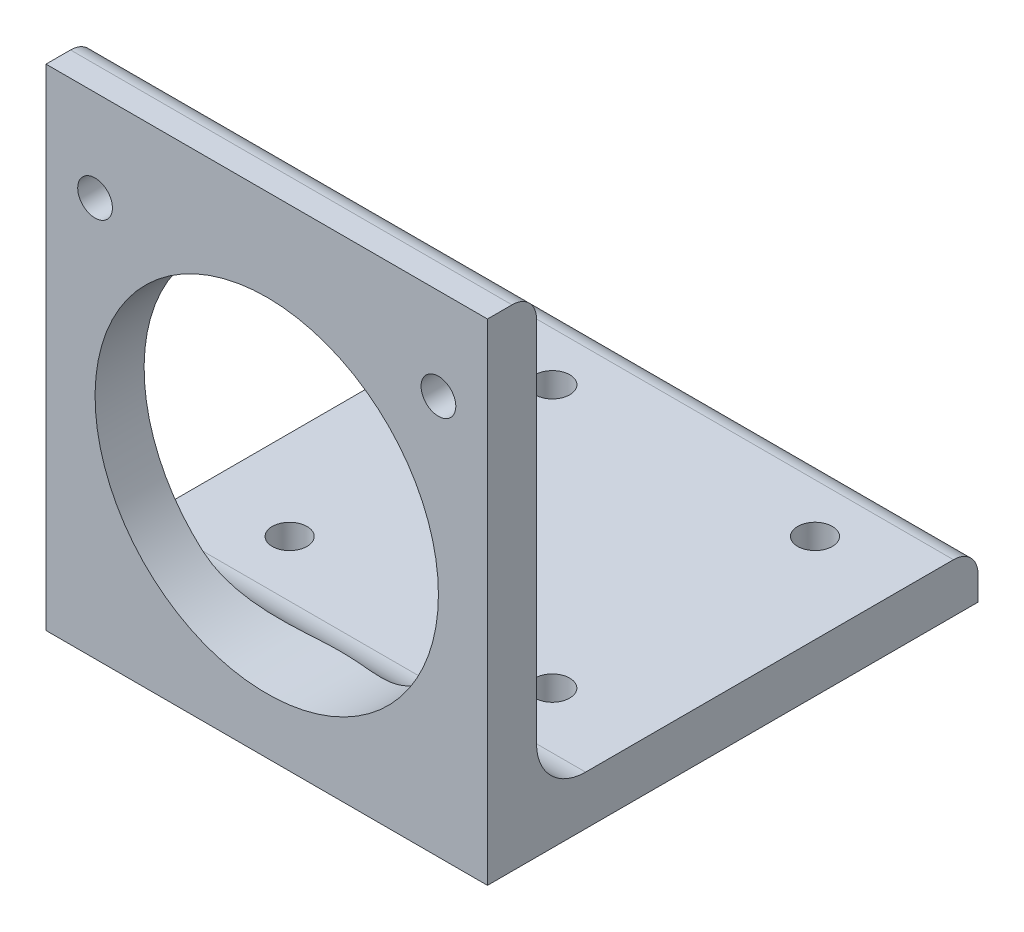
ISO-10303-21;
HEADER;
FILE_DESCRIPTION(('STEP AP214'),'2;1');
FILE_NAME('part.step','',(''),(''),'','','');
FILE_SCHEMA(('AUTOMOTIVE_DESIGN { 1 0 10303 214 1 1 1 1 }'));
ENDSEC;
DATA;
#1=APPLICATION_CONTEXT('core data for automotive mechanical design processes');
#2=APPLICATION_PROTOCOL_DEFINITION('international standard','automotive_design',2000,#1);
#3=PRODUCT_CONTEXT('',#1,'mechanical');
#4=PRODUCT('Part','Part','',(#3));
#5=PRODUCT_RELATED_PRODUCT_CATEGORY('part','',(#4));
#6=PRODUCT_DEFINITION_FORMATION('','',#4);
#7=PRODUCT_DEFINITION_CONTEXT('part definition',#1,'design');
#8=PRODUCT_DEFINITION('design','',#6,#7);
#9=PRODUCT_DEFINITION_SHAPE('','',#8);
#10=(LENGTH_UNIT() NAMED_UNIT(*) SI_UNIT(.MILLI.,.METRE.));
#11=(NAMED_UNIT(*) PLANE_ANGLE_UNIT() SI_UNIT($,.RADIAN.));
#12=(NAMED_UNIT(*) SI_UNIT($,.STERADIAN.) SOLID_ANGLE_UNIT());
#13=UNCERTAINTY_MEASURE_WITH_UNIT(LENGTH_MEASURE(1.E-05),#10,'distance_accuracy_value','');
#14=(GEOMETRIC_REPRESENTATION_CONTEXT(3) GLOBAL_UNCERTAINTY_ASSIGNED_CONTEXT((#13)) GLOBAL_UNIT_ASSIGNED_CONTEXT((#10,
#11,#12)) REPRESENTATION_CONTEXT('',''));
#15=CARTESIAN_POINT('',(0.,0.,0.));
#16=DIRECTION('',(0.,0.,1.));
#17=DIRECTION('',(1.,0.,0.));
#18=AXIS2_PLACEMENT_3D('',#15,#16,#17);
#19=CARTESIAN_POINT('',(57.15,-25.4,0.));
#20=DIRECTION('',(0.,1.,0.));
#21=DIRECTION('',(0.,0.,1.));
#22=AXIS2_PLACEMENT_3D('',#19,#20,#21);
#23=PLANE('',#22);
#24=CARTESIAN_POINT('',(45.575,-25.4,-50.8));
#25=DIRECTION('',(0.,1.,0.));
#26=DIRECTION('',(0.,0.,1.));
#27=AXIS2_PLACEMENT_3D('',#24,#25,#26);
#28=CIRCLE('',#27,2.24999999999999);
#29=CARTESIAN_POINT('',(45.575,-25.4,-48.55));
#30=VERTEX_POINT('',#29);
#31=EDGE_CURVE('E238',#30,#30,#28,.T.);
#32=ORIENTED_EDGE('',*,*,#31,.F.);
#33=EDGE_LOOP('',(#32));
#34=FACE_BOUND('',#33,.T.);
#35=CARTESIAN_POINT('',(11.575,-25.4,-50.8));
#36=DIRECTION('',(0.,1.,0.));
#37=DIRECTION('',(0.,0.,1.));
#38=AXIS2_PLACEMENT_3D('',#35,#36,#37);
#39=CIRCLE('',#38,2.24999999999999);
#40=CARTESIAN_POINT('',(11.575,-25.4,-48.55));
#41=VERTEX_POINT('',#40);
#42=EDGE_CURVE('E232',#41,#41,#39,.T.);
#43=ORIENTED_EDGE('',*,*,#42,.F.);
#44=EDGE_LOOP('',(#43));
#45=FACE_BOUND('',#44,.T.);
#46=CARTESIAN_POINT('',(11.5749999999996,-25.4,-16.7894));
#47=DIRECTION('',(0.,1.,0.));
#48=DIRECTION('',(0.,0.,1.));
#49=AXIS2_PLACEMENT_3D('',#46,#47,#48);
#50=CIRCLE('',#49,2.24999999999999);
#51=CARTESIAN_POINT('',(11.5749999999996,-25.4,-14.5394));
#52=VERTEX_POINT('',#51);
#53=EDGE_CURVE('E226',#52,#52,#50,.T.);
#54=ORIENTED_EDGE('',*,*,#53,.F.);
#55=EDGE_LOOP('',(#54));
#56=FACE_BOUND('',#55,.T.);
#57=CARTESIAN_POINT('',(45.5749999999996,-25.4,-16.7894));
#58=DIRECTION('',(0.,1.,0.));
#59=DIRECTION('',(0.,0.,1.));
#60=AXIS2_PLACEMENT_3D('',#57,#58,#59);
#61=CIRCLE('',#60,2.24999999999999);
#62=CARTESIAN_POINT('',(45.5749999999996,-25.4,-14.5394));
#63=VERTEX_POINT('',#62);
#64=EDGE_CURVE('E157',#63,#63,#61,.T.);
#65=ORIENTED_EDGE('',*,*,#64,.F.);
#66=EDGE_LOOP('',(#65));
#67=FACE_BOUND('',#66,.T.);
#68=DIRECTION('',(0.,0.,-1.));
#69=VECTOR('',#68,1.);
#70=CARTESIAN_POINT('',(0.,-25.4,0.));
#71=LINE('',#70,#69);
#72=CARTESIAN_POINT('',(0.,-25.4,-9.52500000000004));
#73=VERTEX_POINT('',#72);
#74=CARTESIAN_POINT('',(0.,-25.4,-57.15));
#75=VERTEX_POINT('',#74);
#76=EDGE_CURVE('E154',#73,#75,#71,.T.);
#77=ORIENTED_EDGE('',*,*,#76,.F.);
#78=DIRECTION('',(-1.,0.,0.));
#79=VECTOR('',#78,1.);
#80=CARTESIAN_POINT('',(57.15,-25.4,-9.52500000000004));
#81=LINE('',#80,#79);
#82=CARTESIAN_POINT('',(57.15,-25.4,-9.52500000000004));
#83=VERTEX_POINT('',#82);
#84=EDGE_CURVE('E12',#83,#73,#81,.T.);
#85=ORIENTED_EDGE('',*,*,#84,.F.);
#86=DIRECTION('',(0.,0.,-1.));
#87=VECTOR('',#86,1.);
#88=CARTESIAN_POINT('',(57.15,-25.4,0.));
#89=LINE('',#88,#87);
#90=CARTESIAN_POINT('',(57.15,-25.4,-57.15));
#91=VERTEX_POINT('',#90);
#92=EDGE_CURVE('E176',#83,#91,#89,.T.);
#93=ORIENTED_EDGE('',*,*,#92,.T.);
#94=DIRECTION('',(-1.,0.,0.));
#95=VECTOR('',#94,1.);
#96=CARTESIAN_POINT('',(57.15,-25.4,-57.15));
#97=LINE('',#96,#95);
#98=EDGE_CURVE('E65',#91,#75,#97,.T.);
#99=ORIENTED_EDGE('',*,*,#98,.T.);
#100=EDGE_LOOP('',(#77,#85,#93,#99));
#101=FACE_BOUND('',#100,.T.);
#102=ADVANCED_FACE('F42',(#34,#45,#56,#67,#101),#23,.T.);
#103=CARTESIAN_POINT('',(57.15,-19.05,-9.525));
#104=DIRECTION('',(-1.,0.,0.));
#105=DIRECTION('',(0.,0.,1.));
#106=AXIS2_PLACEMENT_3D('',#103,#104,#105);
#107=CYLINDRICAL_SURFACE('',#106,6.35);
#108=DIRECTION('',(-1.,0.,0.));
#109=VECTOR('',#108,1.);
#110=CARTESIAN_POINT('',(57.15,-19.0499999999999,-3.175));
#111=LINE('',#110,#109);
#112=CARTESIAN_POINT('',(13.9541281026061,-19.0499999999999,-3.175));
#113=VERTEX_POINT('',#112);
#114=CARTESIAN_POINT('',(0.,-19.0499999999999,-3.175));
#115=VERTEX_POINT('',#114);
#116=EDGE_CURVE('E188',#113,#115,#111,.T.);
#117=ORIENTED_EDGE('',*,*,#116,.F.);
#118=CARTESIAN_POINT('',(13.9541281026062,-19.05,-3.175));
#119=CARTESIAN_POINT('',(14.1073654087794,-19.1838547130359,-3.17500792380375));
#120=CARTESIAN_POINT('',(14.2624067560395,-19.3155655447845,-3.17923124262287));
#121=CARTESIAN_POINT('',(14.5757573419258,-19.5744556422339,-3.19536475929852));
#122=CARTESIAN_POINT('',(14.7340654944991,-19.7016363768262,-3.20727244109928));
#123=CARTESIAN_POINT('',(15.2128605146157,-20.0756224375802,-3.25334673628911));
#124=CARTESIAN_POINT('',(15.5378645058195,-20.3154358971787,-3.29787093323869));
#125=CARTESIAN_POINT('',(16.1946375260982,-20.773146812998,-3.40877546496827));
#126=CARTESIAN_POINT('',(16.5263159275652,-20.9912268051815,-3.47494939000677));
#127=CARTESIAN_POINT('',(17.1980951113371,-21.4078128423592,-3.62480968676828));
#128=CARTESIAN_POINT('',(17.5382009046523,-21.6063068740771,-3.7085067094499));
#129=CARTESIAN_POINT('',(18.4293635883681,-22.0953994138622,-3.94297499080941));
#130=CARTESIAN_POINT('',(18.9860464685175,-22.3709123863836,-4.10411100865935));
#131=CARTESIAN_POINT('',(19.8329569596643,-22.7472233664996,-4.36010991458265));
#132=CARTESIAN_POINT('',(20.1173748152301,-22.8665469024732,-4.44786894731953));
#133=CARTESIAN_POINT('',(20.6901346845775,-23.0929862081292,-4.62627323045292));
#134=CARTESIAN_POINT('',(20.978476259007,-23.2001033322168,-4.71691815920397));
#135=CARTESIAN_POINT('',(21.560431655259,-23.4026739214288,-4.89948341033677));
#136=CARTESIAN_POINT('',(21.8540636111885,-23.4980715487816,-4.9914076786287));
#137=CARTESIAN_POINT('',(22.4454291600344,-23.6766610038788,-5.17381719125193));
#138=CARTESIAN_POINT('',(22.7431623339011,-23.7598540686752,-5.26430258059763));
#139=CARTESIAN_POINT('',(23.3427639820287,-23.9139479355227,-5.44109945406333));
#140=CARTESIAN_POINT('',(23.6446290308413,-23.9848583245484,-5.5274141552311));
#141=CARTESIAN_POINT('',(24.2530859890712,-24.1143458810592,-5.69277644359117));
#142=CARTESIAN_POINT('',(24.5596792931539,-24.1729193319175,-5.77182183680228));
#143=CARTESIAN_POINT('',(25.2350521543319,-24.2871469357991,-5.93247860902753));
#144=CARTESIAN_POINT('',(25.6048146545227,-24.3402427630944,-6.01184462912828));
#145=CARTESIAN_POINT('',(26.3506435063858,-24.4279900179201,-6.14766850992034));
#146=CARTESIAN_POINT('',(26.7267054142385,-24.4626539258989,-6.20414186530531));
#147=CARTESIAN_POINT('',(27.2926217355982,-24.5001707146661,-6.26636705852351));
#148=CARTESIAN_POINT('',(27.4808064389842,-24.5102512868511,-6.28333764507037));
#149=CARTESIAN_POINT('',(27.8579067937454,-24.525629446782,-6.30937866997296));
#150=CARTESIAN_POINT('',(28.0468223437889,-24.5309276753006,-6.3184501666997));
#151=CARTESIAN_POINT('',(28.4249413727284,-24.53669762016,-6.32833225319066));
#152=CARTESIAN_POINT('',(28.6141448436154,-24.537169468386,-6.32914306868529));
#153=CARTESIAN_POINT('',(28.9923458962635,-24.5332864451186,-6.32249018191473));
#154=CARTESIAN_POINT('',(29.1813434745481,-24.5289314933533,-6.31502634203829));
#155=CARTESIAN_POINT('',(29.7462369070526,-24.5087055363299,-6.28064305304191));
#156=CARTESIAN_POINT('',(30.1212127816047,-24.4856910219585,-6.24176023837488));
#157=CARTESIAN_POINT('',(30.8657348256376,-24.4211956600695,-6.13731777262504));
#158=CARTESIAN_POINT('',(31.2352788389199,-24.3797076735829,-6.07174780928692));
#159=CARTESIAN_POINT('',(31.9715053593977,-24.2785085224186,-5.92034378533631));
#160=CARTESIAN_POINT('',(32.3381212185197,-24.2186174522105,-5.83431165503684));
#161=CARTESIAN_POINT('',(33.0646632720596,-24.0813395999311,-5.64925747120587));
#162=CARTESIAN_POINT('',(33.4245892791218,-24.0039523286584,-5.55023505449287));
#163=CARTESIAN_POINT('',(34.0929024150474,-23.8429126227158,-5.35796507325982));
#164=CARTESIAN_POINT('',(34.4020353260349,-23.7613004060347,-5.26557851710875));
#165=CARTESIAN_POINT('',(35.0158558008515,-23.5850451783893,-5.07838372992641));
#166=CARTESIAN_POINT('',(35.3205428401816,-23.4904006434733,-4.98357521673792));
#167=CARTESIAN_POINT('',(35.9258319653634,-23.2880006137292,-4.79413533394088));
#168=CARTESIAN_POINT('',(36.2264313561917,-23.1802368948965,-4.69950411360029));
#169=CARTESIAN_POINT('',(36.8234040166449,-22.9515709844151,-4.51281007116204));
#170=CARTESIAN_POINT('',(37.119776753436,-22.8306671525325,-4.42074757151543));
#171=CARTESIAN_POINT('',(37.9976035638351,-22.4501587391225,-4.15312687243055));
#172=CARTESIAN_POINT('',(38.572985183031,-22.1710146457551,-3.98442703516678));
#173=CARTESIAN_POINT('',(39.4211420033302,-21.7128152235935,-3.75777093796924));
#174=CARTESIAN_POINT('',(39.7012541954275,-21.5535808208971,-3.68664352684586));
#175=CARTESIAN_POINT('',(40.2561360245125,-21.2218789991948,-3.55530517450685));
#176=CARTESIAN_POINT('',(40.5309060500168,-21.0494125470549,-3.49509343676209));
#177=CARTESIAN_POINT('',(41.2166355090543,-20.5975981370672,-3.35989569839279));
#178=CARTESIAN_POINT('',(41.6237184522845,-20.3094994702659,-3.29363519036644));
#179=CARTESIAN_POINT('',(42.2223666028613,-19.8545880517259,-3.22429770021237));
#180=CARTESIAN_POINT('',(42.42053543191,-19.6986203531976,-3.20618482102653));
#181=CARTESIAN_POINT('',(42.8120178518745,-19.3795522494678,-3.18154135854545));
#182=CARTESIAN_POINT('',(43.0053277196286,-19.2164466222976,-3.17501940514373));
#183=CARTESIAN_POINT('',(43.1958718973939,-19.05,-3.175));
#184=B_SPLINE_CURVE_WITH_KNOTS('',3,(#118,#119,#120,#121,#122,#123,#124,#125,#126,#127,#128,
#129,#130,#131,#132,#133,#134,#135,#136,#137,#138,#139,#140,#141,#142,#143,#144,#145,#146,#147,
#148,#149,#150,#151,#152,#153,#154,#155,#156,#157,#158,#159,#160,#161,#162,#163,#164,#165,#166,
#167,#168,#169,#170,#171,#172,#173,#174,#175,#176,#177,#178,#179,#180,#181,#182,#183),
.UNSPECIFIED.,.F.,.F.,(4,2,2,2,2,2,2,2,2,2,2,2,2,2,2,2,2,2,2,2,2,2,2,2,2,2,2,2,2,2,2,2,4),(0.,
0.610251911560553,1.22030411244461,2.43784344231695,3.64409740379059,4.85108669506011,
6.77300512255604,7.73484804146871,8.69658413159242,9.66273799879141,10.6287938690639,
11.5940922740315,12.5596810702349,13.7044362869521,14.8484153875032,15.4158732404651,
15.9832550500599,16.5506213554047,17.1179970964484,18.2492254770597,19.3808913944103,
20.5239925807547,21.6671257326536,22.6652414350075,23.663473952644,24.6623354846531,
25.6613218445511,27.6420622893919,28.631556051825,29.6209775806833,31.1275128931451,
31.8856544808604,32.6443602982728),.UNSPECIFIED.);
#185=CARTESIAN_POINT('',(43.1958718973939,-19.0499999999999,-3.175));
#186=VERTEX_POINT('',#185);
#187=EDGE_CURVE('E56',#113,#186,#184,.T.);
#188=ORIENTED_EDGE('',*,*,#187,.T.);
#189=CARTESIAN_POINT('',(57.15,-19.0499999999999,-3.175));
#190=VERTEX_POINT('',#189);
#191=EDGE_CURVE('E50',#190,#186,#111,.T.);
#192=ORIENTED_EDGE('',*,*,#191,.F.);
#193=CARTESIAN_POINT('',(57.15,-19.05,-9.525));
#194=DIRECTION('',(1.,0.,0.));
#195=DIRECTION('',(0.,0.,-1.));
#196=AXIS2_PLACEMENT_3D('',#193,#194,#195);
#197=CIRCLE('',#196,6.35);
#198=EDGE_CURVE('E218',#83,#190,#197,.F.);
#199=ORIENTED_EDGE('',*,*,#198,.F.);
#200=ORIENTED_EDGE('',*,*,#84,.T.);
#201=CARTESIAN_POINT('',(0.,-19.05,-9.525));
#202=DIRECTION('',(1.,0.,0.));
#203=DIRECTION('',(0.,0.,-1.));
#204=AXIS2_PLACEMENT_3D('',#201,#202,#203);
#205=CIRCLE('',#204,6.35);
#206=EDGE_CURVE('E156',#73,#115,#205,.F.);
#207=ORIENTED_EDGE('',*,*,#206,.T.);
#208=EDGE_LOOP('',(#117,#188,#192,#199,#200,#207));
#209=FACE_BOUND('',#208,.T.);
#210=ADVANCED_FACE('F200',(#209),#107,.F.);
#211=CARTESIAN_POINT('',(57.15,0.,-3.175));
#212=DIRECTION('',(0.,0.,1.));
#213=DIRECTION('',(1.,0.,0.));
#214=AXIS2_PLACEMENT_3D('',#211,#212,#213);
#215=PLANE('',#214);
#216=CARTESIAN_POINT('',(50.8,19.9136,-3.175));
#217=DIRECTION('',(0.,0.,-1.));
#218=DIRECTION('',(-1.,0.,0.));
#219=AXIS2_PLACEMENT_3D('',#216,#217,#218);
#220=CIRCLE('',#219,2.24789999999999);
#221=CARTESIAN_POINT('',(48.5521,19.9136,-3.175));
#222=VERTEX_POINT('',#221);
#223=EDGE_CURVE('E328',#222,#222,#220,.T.);
#224=ORIENTED_EDGE('',*,*,#223,.F.);
#225=EDGE_LOOP('',(#224));
#226=FACE_BOUND('',#225,.T.);
#227=CARTESIAN_POINT('',(6.35000000000001,19.9136,-3.175));
#228=DIRECTION('',(0.,0.,-1.));
#229=DIRECTION('',(-1.,0.,0.));
#230=AXIS2_PLACEMENT_3D('',#227,#228,#229);
#231=CIRCLE('',#230,2.24789999999999);
#232=CARTESIAN_POINT('',(4.10210000000002,19.9136,-3.175));
#233=VERTEX_POINT('',#232);
#234=EDGE_CURVE('E319',#233,#233,#231,.T.);
#235=ORIENTED_EDGE('',*,*,#234,.F.);
#236=EDGE_LOOP('',(#235));
#237=FACE_BOUND('',#236,.T.);
#238=ORIENTED_EDGE('',*,*,#191,.T.);
#239=CARTESIAN_POINT('',(28.575,-2.31139999999999,-3.175));
#240=DIRECTION('',(0.,0.,1.));
#241=DIRECTION('',(1.,0.,0.));
#242=AXIS2_PLACEMENT_3D('',#239,#240,#241);
#243=CIRCLE('',#242,22.225);
#244=EDGE_CURVE('E197',#186,#113,#243,.T.);
#245=ORIENTED_EDGE('',*,*,#244,.T.);
#246=ORIENTED_EDGE('',*,*,#116,.T.);
#247=DIRECTION('',(0.,1.,0.));
#248=VECTOR('',#247,1.);
#249=CARTESIAN_POINT('',(0.,0.,-3.175));
#250=LINE('',#249,#248);
#251=CARTESIAN_POINT('',(0.,28.575,-3.175));
#252=VERTEX_POINT('',#251);
#253=EDGE_CURVE('E160',#115,#252,#250,.T.);
#254=ORIENTED_EDGE('',*,*,#253,.T.);
#255=DIRECTION('',(-1.,0.,0.));
#256=VECTOR('',#255,1.);
#257=CARTESIAN_POINT('',(57.15,28.575,-3.175));
#258=LINE('',#257,#256);
#259=CARTESIAN_POINT('',(57.15,28.575,-3.175));
#260=VERTEX_POINT('',#259);
#261=EDGE_CURVE('E185',#260,#252,#258,.T.);
#262=ORIENTED_EDGE('',*,*,#261,.F.);
#263=DIRECTION('',(0.,1.,0.));
#264=VECTOR('',#263,1.);
#265=CARTESIAN_POINT('',(57.15,0.,-3.175));
#266=LINE('',#265,#264);
#267=EDGE_CURVE('E214',#190,#260,#266,.T.);
#268=ORIENTED_EDGE('',*,*,#267,.F.);
#269=EDGE_LOOP('',(#238,#245,#246,#254,#262,#268));
#270=FACE_BOUND('',#269,.T.);
#271=ADVANCED_FACE('F194',(#226,#237,#270),#215,.F.);
#272=CARTESIAN_POINT('',(57.15,28.575,0.));
#273=DIRECTION('',(-1.,0.,0.));
#274=DIRECTION('',(0.,0.,1.));
#275=AXIS2_PLACEMENT_3D('',#272,#273,#274);
#276=CYLINDRICAL_SURFACE('',#275,3.175);
#277=CARTESIAN_POINT('',(0.,28.575,0.));
#278=DIRECTION('',(1.,0.,0.));
#279=DIRECTION('',(0.,0.,-1.));
#280=AXIS2_PLACEMENT_3D('',#277,#278,#279);
#281=CIRCLE('',#280,3.175);
#282=CARTESIAN_POINT('',(0.,31.75,0.));
#283=VERTEX_POINT('',#282);
#284=EDGE_CURVE('E162',#252,#283,#281,.T.);
#285=ORIENTED_EDGE('',*,*,#284,.T.);
#286=DIRECTION('',(-1.,0.,0.));
#287=VECTOR('',#286,1.);
#288=CARTESIAN_POINT('',(57.15,31.75,0.));
#289=LINE('',#288,#287);
#290=CARTESIAN_POINT('',(57.15,31.75,0.));
#291=VERTEX_POINT('',#290);
#292=EDGE_CURVE('E182',#291,#283,#289,.T.);
#293=ORIENTED_EDGE('',*,*,#292,.F.);
#294=CARTESIAN_POINT('',(57.15,28.575,0.));
#295=DIRECTION('',(1.,0.,0.));
#296=DIRECTION('',(0.,0.,-1.));
#297=AXIS2_PLACEMENT_3D('',#294,#295,#296);
#298=CIRCLE('',#297,3.175);
#299=EDGE_CURVE('E213',#260,#291,#298,.T.);
#300=ORIENTED_EDGE('',*,*,#299,.F.);
#301=ORIENTED_EDGE('',*,*,#261,.T.);
#302=EDGE_LOOP('',(#285,#293,#300,#301));
#303=FACE_BOUND('',#302,.T.);
#304=ADVANCED_FACE('F207',(#303),#276,.T.);
#305=CARTESIAN_POINT('',(57.15,31.75,0.));
#306=DIRECTION('',(0.,-1.,0.));
#307=DIRECTION('',(0.,0.,-1.));
#308=AXIS2_PLACEMENT_3D('',#305,#306,#307);
#309=PLANE('',#308);
#310=DIRECTION('',(0.,0.,1.));
#311=VECTOR('',#310,1.);
#312=CARTESIAN_POINT('',(0.,31.75,0.));
#313=LINE('',#312,#311);
#314=CARTESIAN_POINT('',(0.,31.75,3.175));
#315=VERTEX_POINT('',#314);
#316=EDGE_CURVE('E164',#283,#315,#313,.T.);
#317=ORIENTED_EDGE('',*,*,#316,.T.);
#318=DIRECTION('',(-1.,0.,0.));
#319=VECTOR('',#318,1.);
#320=CARTESIAN_POINT('',(57.15,31.75,3.175));
#321=LINE('',#320,#319);
#322=CARTESIAN_POINT('',(57.15,31.75,3.175));
#323=VERTEX_POINT('',#322);
#324=EDGE_CURVE('E180',#323,#315,#321,.T.);
#325=ORIENTED_EDGE('',*,*,#324,.F.);
#326=DIRECTION('',(0.,0.,1.));
#327=VECTOR('',#326,1.);
#328=CARTESIAN_POINT('',(57.15,31.75,0.));
#329=LINE('',#328,#327);
#330=EDGE_CURVE('E149',#291,#323,#329,.T.);
#331=ORIENTED_EDGE('',*,*,#330,.F.);
#332=ORIENTED_EDGE('',*,*,#292,.T.);
#333=EDGE_LOOP('',(#317,#325,#331,#332));
#334=FACE_BOUND('',#333,.T.);
#335=ADVANCED_FACE('F211',(#334),#309,.F.);
#336=CARTESIAN_POINT('',(57.15,0.,3.175));
#337=DIRECTION('',(0.,0.,1.));
#338=DIRECTION('',(1.,0.,0.));
#339=AXIS2_PLACEMENT_3D('',#336,#337,#338);
#340=PLANE('',#339);
#341=CARTESIAN_POINT('',(50.8,19.9136,3.175));
#342=DIRECTION('',(0.,0.,-1.));
#343=DIRECTION('',(-1.,0.,0.));
#344=AXIS2_PLACEMENT_3D('',#341,#342,#343);
#345=CIRCLE('',#344,2.24789999999999);
#346=CARTESIAN_POINT('',(48.5521,19.9136,3.175));
#347=VERTEX_POINT('',#346);
#348=EDGE_CURVE('E323',#347,#347,#345,.T.);
#349=ORIENTED_EDGE('',*,*,#348,.T.);
#350=EDGE_LOOP('',(#349));
#351=FACE_BOUND('',#350,.T.);
#352=CARTESIAN_POINT('',(6.35000000000001,19.9136,3.175));
#353=DIRECTION('',(0.,0.,-1.));
#354=DIRECTION('',(-1.,0.,0.));
#355=AXIS2_PLACEMENT_3D('',#352,#353,#354);
#356=CIRCLE('',#355,2.24789999999999);
#357=CARTESIAN_POINT('',(4.10210000000002,19.9136,3.175));
#358=VERTEX_POINT('',#357);
#359=EDGE_CURVE('E316',#358,#358,#356,.T.);
#360=ORIENTED_EDGE('',*,*,#359,.T.);
#361=EDGE_LOOP('',(#360));
#362=FACE_BOUND('',#361,.T.);
#363=CARTESIAN_POINT('',(28.575,-2.31139999999999,3.175));
#364=DIRECTION('',(0.,0.,1.));
#365=DIRECTION('',(1.,0.,0.));
#366=AXIS2_PLACEMENT_3D('',#363,#364,#365);
#367=CIRCLE('',#366,22.225);
#368=CARTESIAN_POINT('',(50.8,-2.31139999999999,3.175));
#369=VERTEX_POINT('',#368);
#370=EDGE_CURVE('E45',#369,#369,#367,.T.);
#371=ORIENTED_EDGE('',*,*,#370,.F.);
#372=EDGE_LOOP('',(#371));
#373=FACE_BOUND('',#372,.T.);
#374=DIRECTION('',(0.,1.,0.));
#375=VECTOR('',#374,1.);
#376=CARTESIAN_POINT('',(0.,0.,3.175));
#377=LINE('',#376,#375);
#378=CARTESIAN_POINT('',(0.,-31.75,3.175));
#379=VERTEX_POINT('',#378);
#380=EDGE_CURVE('E167',#379,#315,#377,.T.);
#381=ORIENTED_EDGE('',*,*,#380,.F.);
#382=DIRECTION('',(-1.,0.,0.));
#383=VECTOR('',#382,1.);
#384=CARTESIAN_POINT('',(57.15,-31.75,3.175));
#385=LINE('',#384,#383);
#386=CARTESIAN_POINT('',(57.15,-31.75,3.175));
#387=VERTEX_POINT('',#386);
#388=EDGE_CURVE('E133',#387,#379,#385,.T.);
#389=ORIENTED_EDGE('',*,*,#388,.F.);
#390=DIRECTION('',(0.,1.,0.));
#391=VECTOR('',#390,1.);
#392=CARTESIAN_POINT('',(57.15,0.,3.175));
#393=LINE('',#392,#391);
#394=EDGE_CURVE('E147',#387,#323,#393,.T.);
#395=ORIENTED_EDGE('',*,*,#394,.T.);
#396=ORIENTED_EDGE('',*,*,#324,.T.);
#397=EDGE_LOOP('',(#381,#389,#395,#396));
#398=FACE_BOUND('',#397,.T.);
#399=ADVANCED_FACE('F287',(#351,#362,#373,#398),#340,.T.);
#400=CARTESIAN_POINT('',(57.15,-31.75,0.));
#401=DIRECTION('',(0.,-1.,0.));
#402=DIRECTION('',(0.,0.,-1.));
#403=AXIS2_PLACEMENT_3D('',#400,#401,#402);
#404=PLANE('',#403);
#405=CARTESIAN_POINT('',(45.575,-31.75,-50.8));
#406=DIRECTION('',(0.,-1.,0.));
#407=DIRECTION('',(0.,0.,-1.));
#408=AXIS2_PLACEMENT_3D('',#405,#406,#407);
#409=CIRCLE('',#408,2.25);
#410=CARTESIAN_POINT('',(45.575,-31.75,-53.05));
#411=VERTEX_POINT('',#410);
#412=EDGE_CURVE('E241',#411,#411,#409,.T.);
#413=ORIENTED_EDGE('',*,*,#412,.F.);
#414=EDGE_LOOP('',(#413));
#415=FACE_BOUND('',#414,.T.);
#416=CARTESIAN_POINT('',(11.575,-31.75,-50.8));
#417=DIRECTION('',(0.,-1.,0.));
#418=DIRECTION('',(0.,0.,-1.));
#419=AXIS2_PLACEMENT_3D('',#416,#417,#418);
#420=CIRCLE('',#419,2.24999999999999);
#421=CARTESIAN_POINT('',(11.575,-31.75,-53.05));
#422=VERTEX_POINT('',#421);
#423=EDGE_CURVE('E235',#422,#422,#420,.T.);
#424=ORIENTED_EDGE('',*,*,#423,.F.);
#425=EDGE_LOOP('',(#424));
#426=FACE_BOUND('',#425,.T.);
#427=CARTESIAN_POINT('',(11.5749999999996,-31.75,-16.7894));
#428=DIRECTION('',(0.,-1.,0.));
#429=DIRECTION('',(0.,0.,-1.));
#430=AXIS2_PLACEMENT_3D('',#427,#428,#429);
#431=CIRCLE('',#430,2.24999999999999);
#432=CARTESIAN_POINT('',(11.5749999999996,-31.75,-19.0394));
#433=VERTEX_POINT('',#432);
#434=EDGE_CURVE('E229',#433,#433,#431,.T.);
#435=ORIENTED_EDGE('',*,*,#434,.F.);
#436=EDGE_LOOP('',(#435));
#437=FACE_BOUND('',#436,.T.);
#438=CARTESIAN_POINT('',(45.5749999999996,-31.75,-16.7894));
#439=DIRECTION('',(0.,-1.,0.));
#440=DIRECTION('',(0.,0.,-1.));
#441=AXIS2_PLACEMENT_3D('',#438,#439,#440);
#442=CIRCLE('',#441,2.25);
#443=CARTESIAN_POINT('',(45.5749999999996,-31.75,-19.0394));
#444=VERTEX_POINT('',#443);
#445=EDGE_CURVE('E223',#444,#444,#442,.T.);
#446=ORIENTED_EDGE('',*,*,#445,.F.);
#447=EDGE_LOOP('',(#446));
#448=FACE_BOUND('',#447,.T.);
#449=DIRECTION('',(0.,0.,1.));
#450=VECTOR('',#449,1.);
#451=CARTESIAN_POINT('',(0.,-31.75,0.));
#452=LINE('',#451,#450);
#453=CARTESIAN_POINT('',(0.,-31.75,-60.325));
#454=VERTEX_POINT('',#453);
#455=EDGE_CURVE('E129',#454,#379,#452,.T.);
#456=ORIENTED_EDGE('',*,*,#455,.F.);
#457=DIRECTION('',(-1.,0.,0.));
#458=VECTOR('',#457,1.);
#459=CARTESIAN_POINT('',(57.15,-31.75,-60.325));
#460=LINE('',#459,#458);
#461=CARTESIAN_POINT('',(57.15,-31.75,-60.325));
#462=VERTEX_POINT('',#461);
#463=EDGE_CURVE('E123',#462,#454,#460,.T.);
#464=ORIENTED_EDGE('',*,*,#463,.F.);
#465=DIRECTION('',(0.,0.,1.));
#466=VECTOR('',#465,1.);
#467=CARTESIAN_POINT('',(57.15,-31.75,0.));
#468=LINE('',#467,#466);
#469=EDGE_CURVE('E127',#462,#387,#468,.T.);
#470=ORIENTED_EDGE('',*,*,#469,.T.);
#471=ORIENTED_EDGE('',*,*,#388,.T.);
#472=EDGE_LOOP('',(#456,#464,#470,#471));
#473=FACE_BOUND('',#472,.T.);
#474=ADVANCED_FACE('F125',(#415,#426,#437,#448,#473),#404,.T.);
#475=CARTESIAN_POINT('',(57.15,0.,-60.325));
#476=DIRECTION('',(0.,0.,1.));
#477=DIRECTION('',(1.,0.,0.));
#478=AXIS2_PLACEMENT_3D('',#475,#476,#477);
#479=PLANE('',#478);
#480=DIRECTION('',(0.,1.,0.));
#481=VECTOR('',#480,1.);
#482=CARTESIAN_POINT('',(0.,0.,-60.325));
#483=LINE('',#482,#481);
#484=CARTESIAN_POINT('',(0.,-28.575,-60.325));
#485=VERTEX_POINT('',#484);
#486=EDGE_CURVE('E171',#454,#485,#483,.T.);
#487=ORIENTED_EDGE('',*,*,#486,.T.);
#488=DIRECTION('',(-1.,0.,0.));
#489=VECTOR('',#488,1.);
#490=CARTESIAN_POINT('',(57.15,-28.575,-60.325));
#491=LINE('',#490,#489);
#492=CARTESIAN_POINT('',(57.15,-28.575,-60.325));
#493=VERTEX_POINT('',#492);
#494=EDGE_CURVE('E134',#493,#485,#491,.T.);
#495=ORIENTED_EDGE('',*,*,#494,.F.);
#496=DIRECTION('',(0.,1.,0.));
#497=VECTOR('',#496,1.);
#498=CARTESIAN_POINT('',(57.15,0.,-60.325));
#499=LINE('',#498,#497);
#500=EDGE_CURVE('E137',#462,#493,#499,.T.);
#501=ORIENTED_EDGE('',*,*,#500,.F.);
#502=ORIENTED_EDGE('',*,*,#463,.T.);
#503=EDGE_LOOP('',(#487,#495,#501,#502));
#504=FACE_BOUND('',#503,.T.);
#505=ADVANCED_FACE('F138',(#504),#479,.F.);
#506=CARTESIAN_POINT('',(57.15,-28.575,-57.15));
#507=DIRECTION('',(-1.,0.,0.));
#508=DIRECTION('',(0.,0.,1.));
#509=AXIS2_PLACEMENT_3D('',#506,#507,#508);
#510=CYLINDRICAL_SURFACE('',#509,3.175);
#511=CARTESIAN_POINT('',(0.,-28.575,-57.15));
#512=DIRECTION('',(1.,0.,0.));
#513=DIRECTION('',(0.,0.,-1.));
#514=AXIS2_PLACEMENT_3D('',#511,#512,#513);
#515=CIRCLE('',#514,3.175);
#516=EDGE_CURVE('E173',#75,#485,#515,.F.);
#517=ORIENTED_EDGE('',*,*,#516,.F.);
#518=ORIENTED_EDGE('',*,*,#98,.F.);
#519=CARTESIAN_POINT('',(57.15,-28.575,-57.15));
#520=DIRECTION('',(1.,0.,0.));
#521=DIRECTION('',(0.,0.,-1.));
#522=AXIS2_PLACEMENT_3D('',#519,#520,#521);
#523=CIRCLE('',#522,3.175);
#524=EDGE_CURVE('E141',#91,#493,#523,.F.);
#525=ORIENTED_EDGE('',*,*,#524,.T.);
#526=ORIENTED_EDGE('',*,*,#494,.T.);
#527=EDGE_LOOP('',(#517,#518,#525,#526));
#528=FACE_BOUND('',#527,.T.);
#529=ADVANCED_FACE('F278',(#528),#510,.T.);
#530=CARTESIAN_POINT('',(57.15,0.,0.));
#531=DIRECTION('',(1.,0.,0.));
#532=DIRECTION('',(0.,0.,-1.));
#533=AXIS2_PLACEMENT_3D('',#530,#531,#532);
#534=PLANE('',#533);
#535=ORIENTED_EDGE('',*,*,#92,.F.);
#536=ORIENTED_EDGE('',*,*,#198,.T.);
#537=ORIENTED_EDGE('',*,*,#267,.T.);
#538=ORIENTED_EDGE('',*,*,#299,.T.);
#539=ORIENTED_EDGE('',*,*,#330,.T.);
#540=ORIENTED_EDGE('',*,*,#394,.F.);
#541=ORIENTED_EDGE('',*,*,#469,.F.);
#542=ORIENTED_EDGE('',*,*,#500,.T.);
#543=ORIENTED_EDGE('',*,*,#524,.F.);
#544=EDGE_LOOP('',(#535,#536,#537,#538,#539,#540,#541,#542,#543));
#545=FACE_BOUND('',#544,.T.);
#546=ADVANCED_FACE('F145',(#545),#534,.T.);
#547=CARTESIAN_POINT('',(0.,0.,0.));
#548=DIRECTION('',(1.,0.,0.));
#549=DIRECTION('',(0.,0.,-1.));
#550=AXIS2_PLACEMENT_3D('',#547,#548,#549);
#551=PLANE('',#550);
#552=ORIENTED_EDGE('',*,*,#76,.T.);
#553=ORIENTED_EDGE('',*,*,#516,.T.);
#554=ORIENTED_EDGE('',*,*,#486,.F.);
#555=ORIENTED_EDGE('',*,*,#455,.T.);
#556=ORIENTED_EDGE('',*,*,#380,.T.);
#557=ORIENTED_EDGE('',*,*,#316,.F.);
#558=ORIENTED_EDGE('',*,*,#284,.F.);
#559=ORIENTED_EDGE('',*,*,#253,.F.);
#560=ORIENTED_EDGE('',*,*,#206,.F.);
#561=EDGE_LOOP('',(#552,#553,#554,#555,#556,#557,#558,#559,#560));
#562=FACE_BOUND('',#561,.T.);
#563=ADVANCED_FACE('F203',(#562),#551,.F.);
#564=CARTESIAN_POINT('',(45.5749999999996,-31.75,-16.7894));
#565=DIRECTION('',(0.,-1.,0.));
#566=DIRECTION('',(0.,0.,-1.));
#567=AXIS2_PLACEMENT_3D('',#564,#565,#566);
#568=CYLINDRICAL_SURFACE('',#567,2.24999999999999);
#569=ORIENTED_EDGE('',*,*,#64,.T.);
#570=EDGE_LOOP('',(#569));
#571=FACE_BOUND('',#570,.T.);
#572=ORIENTED_EDGE('',*,*,#445,.T.);
#573=EDGE_LOOP('',(#572));
#574=FACE_BOUND('',#573,.T.);
#575=ADVANCED_FACE('F271',(#571,#574),#568,.F.);
#576=CARTESIAN_POINT('',(11.5749999999996,-31.75,-16.7894));
#577=DIRECTION('',(0.,-1.,0.));
#578=DIRECTION('',(0.,0.,-1.));
#579=AXIS2_PLACEMENT_3D('',#576,#577,#578);
#580=CYLINDRICAL_SURFACE('',#579,2.24999999999999);
#581=ORIENTED_EDGE('',*,*,#53,.T.);
#582=EDGE_LOOP('',(#581));
#583=FACE_BOUND('',#582,.T.);
#584=ORIENTED_EDGE('',*,*,#434,.T.);
#585=EDGE_LOOP('',(#584));
#586=FACE_BOUND('',#585,.T.);
#587=ADVANCED_FACE('F267',(#583,#586),#580,.F.);
#588=CARTESIAN_POINT('',(11.575,-31.75,-50.8));
#589=DIRECTION('',(0.,-1.,0.));
#590=DIRECTION('',(0.,0.,-1.));
#591=AXIS2_PLACEMENT_3D('',#588,#589,#590);
#592=CYLINDRICAL_SURFACE('',#591,2.24999999999999);
#593=ORIENTED_EDGE('',*,*,#42,.T.);
#594=EDGE_LOOP('',(#593));
#595=FACE_BOUND('',#594,.T.);
#596=ORIENTED_EDGE('',*,*,#423,.T.);
#597=EDGE_LOOP('',(#596));
#598=FACE_BOUND('',#597,.T.);
#599=ADVANCED_FACE('F263',(#595,#598),#592,.F.);
#600=CARTESIAN_POINT('',(45.575,-31.75,-50.8));
#601=DIRECTION('',(0.,-1.,0.));
#602=DIRECTION('',(0.,0.,-1.));
#603=AXIS2_PLACEMENT_3D('',#600,#601,#602);
#604=CYLINDRICAL_SURFACE('',#603,2.24999999999999);
#605=ORIENTED_EDGE('',*,*,#31,.T.);
#606=EDGE_LOOP('',(#605));
#607=FACE_BOUND('',#606,.T.);
#608=ORIENTED_EDGE('',*,*,#412,.T.);
#609=EDGE_LOOP('',(#608));
#610=FACE_BOUND('',#609,.T.);
#611=ADVANCED_FACE('F258',(#607,#610),#604,.F.);
#612=CARTESIAN_POINT('',(28.575,-2.31139999999999,25.4));
#613=DIRECTION('',(0.,0.,-1.));
#614=DIRECTION('',(-1.,0.,0.));
#615=AXIS2_PLACEMENT_3D('',#612,#613,#614);
#616=CYLINDRICAL_SURFACE('',#615,22.225);
#617=ORIENTED_EDGE('',*,*,#370,.T.);
#618=EDGE_LOOP('',(#617));
#619=FACE_BOUND('',#618,.T.);
#620=ORIENTED_EDGE('',*,*,#244,.F.);
#621=ORIENTED_EDGE('',*,*,#187,.F.);
#622=EDGE_LOOP('',(#620,#621));
#623=FACE_BOUND('',#622,.T.);
#624=ADVANCED_FACE('F252',(#619,#623),#616,.F.);
#625=CARTESIAN_POINT('',(6.35000000000001,19.9136,-3.175));
#626=DIRECTION('',(0.,0.,-1.));
#627=DIRECTION('',(-1.,0.,0.));
#628=AXIS2_PLACEMENT_3D('',#625,#626,#627);
#629=CYLINDRICAL_SURFACE('',#628,2.24789999999999);
#630=ORIENTED_EDGE('',*,*,#359,.F.);
#631=EDGE_LOOP('',(#630));
#632=FACE_BOUND('',#631,.T.);
#633=ORIENTED_EDGE('',*,*,#234,.T.);
#634=EDGE_LOOP('',(#633));
#635=FACE_BOUND('',#634,.T.);
#636=ADVANCED_FACE('F257',(#632,#635),#629,.F.);
#637=CARTESIAN_POINT('',(50.8,19.9136,-3.175));
#638=DIRECTION('',(0.,0.,-1.));
#639=DIRECTION('',(-1.,0.,0.));
#640=AXIS2_PLACEMENT_3D('',#637,#638,#639);
#641=CYLINDRICAL_SURFACE('',#640,2.24789999999999);
#642=ORIENTED_EDGE('',*,*,#348,.F.);
#643=EDGE_LOOP('',(#642));
#644=FACE_BOUND('',#643,.T.);
#645=ORIENTED_EDGE('',*,*,#223,.T.);
#646=EDGE_LOOP('',(#645));
#647=FACE_BOUND('',#646,.T.);
#648=ADVANCED_FACE('F331',(#644,#647),#641,.F.);
#649=CLOSED_SHELL('',(#102,#210,#271,#304,#335,#399,#474,#505,#529,#546,#563,#575,#587,#599,
#611,#624,#636,#648));
#650=MANIFOLD_SOLID_BREP('B2',#649);
#651=ADVANCED_BREP_SHAPE_REPRESENTATION('',(#18,#650),#14);
#652=SHAPE_DEFINITION_REPRESENTATION(#9,#651);
ENDSEC;
END-ISO-10303-21;
